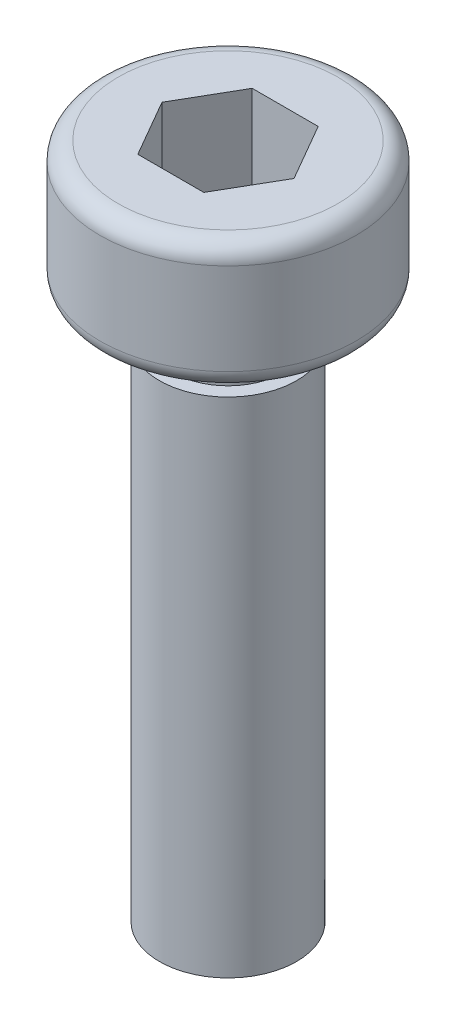
ISO-10303-21;
HEADER;
FILE_DESCRIPTION(('STEP AP214'),'2;1');
FILE_NAME('part.step','',(''),(''),'','','');
FILE_SCHEMA(('AUTOMOTIVE_DESIGN { 1 0 10303 214 1 1 1 1 }'));
ENDSEC;
DATA;
#1=APPLICATION_CONTEXT('core data for automotive mechanical design processes');
#2=APPLICATION_PROTOCOL_DEFINITION('international standard','automotive_design',2000,#1);
#3=PRODUCT_CONTEXT('',#1,'mechanical');
#4=PRODUCT('Part','Part','',(#3));
#5=PRODUCT_RELATED_PRODUCT_CATEGORY('part','',(#4));
#6=PRODUCT_DEFINITION_FORMATION('','',#4);
#7=PRODUCT_DEFINITION_CONTEXT('part definition',#1,'design');
#8=PRODUCT_DEFINITION('design','',#6,#7);
#9=PRODUCT_DEFINITION_SHAPE('','',#8);
#10=(LENGTH_UNIT() NAMED_UNIT(*) SI_UNIT(.MILLI.,.METRE.));
#11=(NAMED_UNIT(*) PLANE_ANGLE_UNIT() SI_UNIT($,.RADIAN.));
#12=(NAMED_UNIT(*) SI_UNIT($,.STERADIAN.) SOLID_ANGLE_UNIT());
#13=UNCERTAINTY_MEASURE_WITH_UNIT(LENGTH_MEASURE(1.E-05),#10,'distance_accuracy_value','');
#14=(GEOMETRIC_REPRESENTATION_CONTEXT(3) GLOBAL_UNCERTAINTY_ASSIGNED_CONTEXT((#13)) GLOBAL_UNIT_ASSIGNED_CONTEXT((#10,
#11,#12)) REPRESENTATION_CONTEXT('',''));
#15=CARTESIAN_POINT('',(0.,0.,0.));
#16=DIRECTION('',(0.,0.,1.));
#17=DIRECTION('',(1.,0.,0.));
#18=AXIS2_PLACEMENT_3D('',#15,#16,#17);
#19=CARTESIAN_POINT('',(0.,14.8,0.));
#20=DIRECTION('',(0.,-1.,0.));
#21=DIRECTION('',(0.,0.,-1.));
#22=AXIS2_PLACEMENT_3D('',#19,#20,#21);
#23=PLANE('',#22);
#24=DIRECTION('',(-0.5,0.,0.866025403784439));
#25=VECTOR('',#24,1.);
#26=CARTESIAN_POINT('',(-0.721687836487032,14.8,-1.25));
#27=LINE('',#26,#25);
#28=CARTESIAN_POINT('',(-0.721687836487032,14.8,-1.25));
#29=VERTEX_POINT('',#28);
#30=CARTESIAN_POINT('',(-1.44337567297406,14.8,0.));
#31=VERTEX_POINT('',#30);
#32=EDGE_CURVE('E124',#29,#31,#27,.T.);
#33=ORIENTED_EDGE('',*,*,#32,.F.);
#34=DIRECTION('',(-1.,0.,0.));
#35=VECTOR('',#34,1.);
#36=CARTESIAN_POINT('',(0.721687836487033,14.8,-1.25));
#37=LINE('',#36,#35);
#38=CARTESIAN_POINT('',(0.721687836487033,14.8,-1.25));
#39=VERTEX_POINT('',#38);
#40=EDGE_CURVE('E50',#39,#29,#37,.T.);
#41=ORIENTED_EDGE('',*,*,#40,.F.);
#42=DIRECTION('',(-0.5,0.,-0.866025403784439));
#43=VECTOR('',#42,1.);
#44=CARTESIAN_POINT('',(1.44337567297406,14.8,0.));
#45=LINE('',#44,#43);
#46=CARTESIAN_POINT('',(1.44337567297406,14.8,0.));
#47=VERTEX_POINT('',#46);
#48=EDGE_CURVE('E133',#47,#39,#45,.T.);
#49=ORIENTED_EDGE('',*,*,#48,.F.);
#50=DIRECTION('',(0.5,0.,-0.866025403784439));
#51=VECTOR('',#50,1.);
#52=CARTESIAN_POINT('',(0.721687836487032,14.8,1.25));
#53=LINE('',#52,#51);
#54=CARTESIAN_POINT('',(0.721687836487032,14.8,1.25));
#55=VERTEX_POINT('',#54);
#56=EDGE_CURVE('E131',#55,#47,#53,.T.);
#57=ORIENTED_EDGE('',*,*,#56,.F.);
#58=DIRECTION('',(1.,0.,0.));
#59=VECTOR('',#58,1.);
#60=CARTESIAN_POINT('',(-0.721687836487033,14.8,1.25));
#61=LINE('',#60,#59);
#62=CARTESIAN_POINT('',(-0.721687836487033,14.8,1.25));
#63=VERTEX_POINT('',#62);
#64=EDGE_CURVE('E98',#63,#55,#61,.T.);
#65=ORIENTED_EDGE('',*,*,#64,.F.);
#66=DIRECTION('',(0.5,0.,0.866025403784439));
#67=VECTOR('',#66,1.);
#68=CARTESIAN_POINT('',(-1.44337567297406,14.8,0.));
#69=LINE('',#68,#67);
#70=EDGE_CURVE('E127',#31,#63,#69,.T.);
#71=ORIENTED_EDGE('',*,*,#70,.F.);
#72=EDGE_LOOP('',(#33,#41,#49,#57,#65,#71));
#73=FACE_BOUND('',#72,.T.);
#74=CARTESIAN_POINT('',(0.,14.8,0.));
#75=DIRECTION('',(0.,-1.,0.));
#76=DIRECTION('',(0.,0.,-1.));
#77=AXIS2_PLACEMENT_3D('',#74,#75,#76);
#78=CIRCLE('',#77,2.4);
#79=CARTESIAN_POINT('',(0.,14.8,-2.4));
#80=VERTEX_POINT('',#79);
#81=EDGE_CURVE('E11',#80,#80,#78,.T.);
#82=ORIENTED_EDGE('',*,*,#81,.F.);
#83=EDGE_LOOP('',(#82));
#84=FACE_BOUND('',#83,.T.);
#85=ADVANCED_FACE('F36',(#73,#84),#23,.F.);
#86=CARTESIAN_POINT('',(0.,14.4,0.));
#87=DIRECTION('',(0.,-1.,0.));
#88=DIRECTION('',(0.,0.,-1.));
#89=AXIS2_PLACEMENT_3D('',#86,#87,#88);
#90=TOROIDAL_SURFACE('',#89,2.4,0.399999999999999);
#91=CARTESIAN_POINT('',(0.,14.4,0.));
#92=DIRECTION('',(0.,-1.,0.));
#93=DIRECTION('',(0.,0.,-1.));
#94=AXIS2_PLACEMENT_3D('',#91,#92,#93);
#95=CIRCLE('',#94,2.8);
#96=CARTESIAN_POINT('',(0.,14.4,-2.8));
#97=VERTEX_POINT('',#96);
#98=EDGE_CURVE('E43',#97,#97,#95,.T.);
#99=ORIENTED_EDGE('',*,*,#98,.F.);
#100=EDGE_LOOP('',(#99));
#101=FACE_BOUND('',#100,.T.);
#102=ORIENTED_EDGE('',*,*,#81,.T.);
#103=EDGE_LOOP('',(#102));
#104=FACE_BOUND('',#103,.T.);
#105=ADVANCED_FACE('F164',(#101,#104),#90,.T.);
#106=CARTESIAN_POINT('',(0.,0.,0.));
#107=DIRECTION('',(0.,-1.,0.));
#108=DIRECTION('',(0.,0.,-1.));
#109=AXIS2_PLACEMENT_3D('',#106,#107,#108);
#110=CYLINDRICAL_SURFACE('',#109,2.8);
#111=CARTESIAN_POINT('',(0.,12.4,0.));
#112=DIRECTION('',(0.,-1.,0.));
#113=DIRECTION('',(0.,0.,-1.));
#114=AXIS2_PLACEMENT_3D('',#111,#112,#113);
#115=CIRCLE('',#114,2.8);
#116=CARTESIAN_POINT('',(0.,12.4,-2.8));
#117=VERTEX_POINT('',#116);
#118=EDGE_CURVE('E157',#117,#117,#115,.T.);
#119=ORIENTED_EDGE('',*,*,#118,.F.);
#120=EDGE_LOOP('',(#119));
#121=FACE_BOUND('',#120,.T.);
#122=ORIENTED_EDGE('',*,*,#98,.T.);
#123=EDGE_LOOP('',(#122));
#124=FACE_BOUND('',#123,.T.);
#125=ADVANCED_FACE('F162',(#121,#124),#110,.T.);
#126=CARTESIAN_POINT('',(0.,12.4,0.));
#127=DIRECTION('',(0.,-1.,0.));
#128=DIRECTION('',(0.,0.,-1.));
#129=AXIS2_PLACEMENT_3D('',#126,#127,#128);
#130=TOROIDAL_SURFACE('',#129,2.4,0.4);
#131=CARTESIAN_POINT('',(0.,12.,0.));
#132=DIRECTION('',(0.,-1.,0.));
#133=DIRECTION('',(0.,0.,-1.));
#134=AXIS2_PLACEMENT_3D('',#131,#132,#133);
#135=CIRCLE('',#134,2.4);
#136=CARTESIAN_POINT('',(0.,12.,-2.4));
#137=VERTEX_POINT('',#136);
#138=EDGE_CURVE('E154',#137,#137,#135,.T.);
#139=ORIENTED_EDGE('',*,*,#138,.F.);
#140=EDGE_LOOP('',(#139));
#141=FACE_BOUND('',#140,.T.);
#142=ORIENTED_EDGE('',*,*,#118,.T.);
#143=EDGE_LOOP('',(#142));
#144=FACE_BOUND('',#143,.T.);
#145=ADVANCED_FACE('F209',(#141,#144),#130,.T.);
#146=CARTESIAN_POINT('',(-2.4,12.,0.));
#147=DIRECTION('',(0.,1.,0.));
#148=DIRECTION('',(0.,0.,1.));
#149=AXIS2_PLACEMENT_3D('',#146,#147,#148);
#150=PLANE('',#149);
#151=CARTESIAN_POINT('',(0.,12.,0.));
#152=DIRECTION('',(0.,-1.,0.));
#153=DIRECTION('',(0.,0.,-1.));
#154=AXIS2_PLACEMENT_3D('',#151,#152,#153);
#155=CIRCLE('',#154,1.2);
#156=CARTESIAN_POINT('',(0.,12.,-1.2));
#157=VERTEX_POINT('',#156);
#158=EDGE_CURVE('E151',#157,#157,#155,.T.);
#159=ORIENTED_EDGE('',*,*,#158,.F.);
#160=EDGE_LOOP('',(#159));
#161=FACE_BOUND('',#160,.T.);
#162=ORIENTED_EDGE('',*,*,#138,.T.);
#163=EDGE_LOOP('',(#162));
#164=FACE_BOUND('',#163,.T.);
#165=ADVANCED_FACE('F205',(#161,#164),#150,.F.);
#166=CARTESIAN_POINT('',(0.,0.,0.));
#167=DIRECTION('',(0.,-1.,0.));
#168=DIRECTION('',(0.,0.,-1.));
#169=AXIS2_PLACEMENT_3D('',#166,#167,#168);
#170=CYLINDRICAL_SURFACE('',#169,1.2);
#171=CARTESIAN_POINT('',(0.,11.,0.));
#172=DIRECTION('',(0.,-1.,0.));
#173=DIRECTION('',(0.,0.,-1.));
#174=AXIS2_PLACEMENT_3D('',#171,#172,#173);
#175=CIRCLE('',#174,1.2);
#176=CARTESIAN_POINT('',(0.,11.,-1.2));
#177=VERTEX_POINT('',#176);
#178=EDGE_CURVE('E148',#177,#177,#175,.T.);
#179=ORIENTED_EDGE('',*,*,#178,.F.);
#180=EDGE_LOOP('',(#179));
#181=FACE_BOUND('',#180,.T.);
#182=ORIENTED_EDGE('',*,*,#158,.T.);
#183=EDGE_LOOP('',(#182));
#184=FACE_BOUND('',#183,.T.);
#185=ADVANCED_FACE('F201',(#181,#184),#170,.T.);
#186=CARTESIAN_POINT('',(-1.2,11.,0.));
#187=DIRECTION('',(0.,-1.,0.));
#188=DIRECTION('',(0.,0.,-1.));
#189=AXIS2_PLACEMENT_3D('',#186,#187,#188);
#190=PLANE('',#189);
#191=CARTESIAN_POINT('',(0.,11.,0.));
#192=DIRECTION('',(0.,-1.,0.));
#193=DIRECTION('',(0.,0.,-1.));
#194=AXIS2_PLACEMENT_3D('',#191,#192,#193);
#195=CIRCLE('',#194,1.5);
#196=CARTESIAN_POINT('',(0.,11.,-1.5));
#197=VERTEX_POINT('',#196);
#198=EDGE_CURVE('E145',#197,#197,#195,.T.);
#199=ORIENTED_EDGE('',*,*,#198,.F.);
#200=EDGE_LOOP('',(#199));
#201=FACE_BOUND('',#200,.T.);
#202=ORIENTED_EDGE('',*,*,#178,.T.);
#203=EDGE_LOOP('',(#202));
#204=FACE_BOUND('',#203,.T.);
#205=ADVANCED_FACE('F197',(#201,#204),#190,.F.);
#206=CARTESIAN_POINT('',(0.,0.,0.));
#207=DIRECTION('',(0.,-1.,0.));
#208=DIRECTION('',(0.,0.,-1.));
#209=AXIS2_PLACEMENT_3D('',#206,#207,#208);
#210=CYLINDRICAL_SURFACE('',#209,1.5);
#211=CARTESIAN_POINT('',(0.,0.,0.));
#212=DIRECTION('',(0.,-1.,0.));
#213=DIRECTION('',(0.,0.,-1.));
#214=AXIS2_PLACEMENT_3D('',#211,#212,#213);
#215=CIRCLE('',#214,1.5);
#216=CARTESIAN_POINT('',(0.,0.,-1.5));
#217=VERTEX_POINT('',#216);
#218=EDGE_CURVE('E137',#217,#217,#215,.T.);
#219=ORIENTED_EDGE('',*,*,#218,.F.);
#220=EDGE_LOOP('',(#219));
#221=FACE_BOUND('',#220,.T.);
#222=ORIENTED_EDGE('',*,*,#198,.T.);
#223=EDGE_LOOP('',(#222));
#224=FACE_BOUND('',#223,.T.);
#225=ADVANCED_FACE('F189',(#221,#224),#210,.T.);
#226=CARTESIAN_POINT('',(-1.5,0.,0.));
#227=DIRECTION('',(0.,1.,0.));
#228=DIRECTION('',(0.,0.,1.));
#229=AXIS2_PLACEMENT_3D('',#226,#227,#228);
#230=PLANE('',#229);
#231=ORIENTED_EDGE('',*,*,#218,.T.);
#232=EDGE_LOOP('',(#231));
#233=FACE_BOUND('',#232,.T.);
#234=ADVANCED_FACE('F182',(#233),#230,.F.);
#235=CARTESIAN_POINT('',(0.721687836487033,12.8,-1.25));
#236=DIRECTION('',(0.,0.,-1.));
#237=DIRECTION('',(-1.,0.,0.));
#238=AXIS2_PLACEMENT_3D('',#235,#236,#237);
#239=PLANE('',#238);
#240=ORIENTED_EDGE('',*,*,#40,.T.);
#241=DIRECTION('',(0.,1.,0.));
#242=VECTOR('',#241,1.);
#243=CARTESIAN_POINT('',(-0.721687836487032,12.8,-1.25));
#244=LINE('',#243,#242);
#245=CARTESIAN_POINT('',(-0.721687836487032,12.8,-1.25));
#246=VERTEX_POINT('',#245);
#247=EDGE_CURVE('E80',#246,#29,#244,.T.);
#248=ORIENTED_EDGE('',*,*,#247,.F.);
#249=DIRECTION('',(-1.,0.,0.));
#250=VECTOR('',#249,1.);
#251=CARTESIAN_POINT('',(0.721687836487033,12.8,-1.25));
#252=LINE('',#251,#250);
#253=CARTESIAN_POINT('',(0.721687836487033,12.8,-1.25));
#254=VERTEX_POINT('',#253);
#255=EDGE_CURVE('E135',#254,#246,#252,.T.);
#256=ORIENTED_EDGE('',*,*,#255,.F.);
#257=DIRECTION('',(0.,1.,0.));
#258=VECTOR('',#257,1.);
#259=CARTESIAN_POINT('',(0.721687836487033,12.8,-1.25));
#260=LINE('',#259,#258);
#261=EDGE_CURVE('E58',#254,#39,#260,.T.);
#262=ORIENTED_EDGE('',*,*,#261,.T.);
#263=EDGE_LOOP('',(#240,#248,#256,#262));
#264=FACE_BOUND('',#263,.T.);
#265=ADVANCED_FACE('F179',(#264),#239,.F.);
#266=CARTESIAN_POINT('',(1.44337567297406,12.8,0.));
#267=DIRECTION('',(0.866025403784439,0.,-0.5));
#268=DIRECTION('',(-0.5,0.,-0.866025403784439));
#269=AXIS2_PLACEMENT_3D('',#266,#267,#268);
#270=PLANE('',#269);
#271=ORIENTED_EDGE('',*,*,#48,.T.);
#272=ORIENTED_EDGE('',*,*,#261,.F.);
#273=DIRECTION('',(-0.5,0.,-0.866025403784439));
#274=VECTOR('',#273,1.);
#275=CARTESIAN_POINT('',(1.44337567297406,12.8,0.));
#276=LINE('',#275,#274);
#277=CARTESIAN_POINT('',(1.44337567297406,12.8,0.));
#278=VERTEX_POINT('',#277);
#279=EDGE_CURVE('E110',#278,#254,#276,.T.);
#280=ORIENTED_EDGE('',*,*,#279,.F.);
#281=DIRECTION('',(0.,1.,0.));
#282=VECTOR('',#281,1.);
#283=CARTESIAN_POINT('',(1.44337567297406,12.8,0.));
#284=LINE('',#283,#282);
#285=EDGE_CURVE('E102',#278,#47,#284,.T.);
#286=ORIENTED_EDGE('',*,*,#285,.T.);
#287=EDGE_LOOP('',(#271,#272,#280,#286));
#288=FACE_BOUND('',#287,.T.);
#289=ADVANCED_FACE('F181',(#288),#270,.F.);
#290=CARTESIAN_POINT('',(0.721687836487032,12.8,1.25));
#291=DIRECTION('',(0.866025403784439,0.,0.5));
#292=DIRECTION('',(0.5,0.,-0.866025403784439));
#293=AXIS2_PLACEMENT_3D('',#290,#291,#292);
#294=PLANE('',#293);
#295=ORIENTED_EDGE('',*,*,#56,.T.);
#296=ORIENTED_EDGE('',*,*,#285,.F.);
#297=DIRECTION('',(0.5,0.,-0.866025403784439));
#298=VECTOR('',#297,1.);
#299=CARTESIAN_POINT('',(0.721687836487032,12.8,1.25));
#300=LINE('',#299,#298);
#301=CARTESIAN_POINT('',(0.721687836487032,12.8,1.25));
#302=VERTEX_POINT('',#301);
#303=EDGE_CURVE('E106',#302,#278,#300,.T.);
#304=ORIENTED_EDGE('',*,*,#303,.F.);
#305=DIRECTION('',(0.,1.,0.));
#306=VECTOR('',#305,1.);
#307=CARTESIAN_POINT('',(0.721687836487032,12.8,1.25));
#308=LINE('',#307,#306);
#309=EDGE_CURVE('E91',#302,#55,#308,.T.);
#310=ORIENTED_EDGE('',*,*,#309,.T.);
#311=EDGE_LOOP('',(#295,#296,#304,#310));
#312=FACE_BOUND('',#311,.T.);
#313=ADVANCED_FACE('F107',(#312),#294,.F.);
#314=CARTESIAN_POINT('',(-0.721687836487033,12.8,1.25));
#315=DIRECTION('',(0.,0.,1.));
#316=DIRECTION('',(1.,0.,0.));
#317=AXIS2_PLACEMENT_3D('',#314,#315,#316);
#318=PLANE('',#317);
#319=ORIENTED_EDGE('',*,*,#64,.T.);
#320=ORIENTED_EDGE('',*,*,#309,.F.);
#321=DIRECTION('',(1.,0.,0.));
#322=VECTOR('',#321,1.);
#323=CARTESIAN_POINT('',(-0.721687836487033,12.8,1.25));
#324=LINE('',#323,#322);
#325=CARTESIAN_POINT('',(-0.721687836487033,12.8,1.25));
#326=VERTEX_POINT('',#325);
#327=EDGE_CURVE('E95',#326,#302,#324,.T.);
#328=ORIENTED_EDGE('',*,*,#327,.F.);
#329=DIRECTION('',(0.,1.,0.));
#330=VECTOR('',#329,1.);
#331=CARTESIAN_POINT('',(-0.721687836487033,12.8,1.25));
#332=LINE('',#331,#330);
#333=EDGE_CURVE('E103',#326,#63,#332,.T.);
#334=ORIENTED_EDGE('',*,*,#333,.T.);
#335=EDGE_LOOP('',(#319,#320,#328,#334));
#336=FACE_BOUND('',#335,.T.);
#337=ADVANCED_FACE('F93',(#336),#318,.F.);
#338=CARTESIAN_POINT('',(-1.44337567297406,12.8,0.));
#339=DIRECTION('',(-0.866025403784439,0.,0.5));
#340=DIRECTION('',(0.5,0.,0.866025403784439));
#341=AXIS2_PLACEMENT_3D('',#338,#339,#340);
#342=PLANE('',#341);
#343=ORIENTED_EDGE('',*,*,#70,.T.);
#344=ORIENTED_EDGE('',*,*,#333,.F.);
#345=DIRECTION('',(0.5,0.,0.866025403784439));
#346=VECTOR('',#345,1.);
#347=CARTESIAN_POINT('',(-1.44337567297406,12.8,0.));
#348=LINE('',#347,#346);
#349=CARTESIAN_POINT('',(-1.44337567297406,12.8,0.));
#350=VERTEX_POINT('',#349);
#351=EDGE_CURVE('E116',#350,#326,#348,.T.);
#352=ORIENTED_EDGE('',*,*,#351,.F.);
#353=DIRECTION('',(0.,1.,0.));
#354=VECTOR('',#353,1.);
#355=CARTESIAN_POINT('',(-1.44337567297406,12.8,0.));
#356=LINE('',#355,#354);
#357=EDGE_CURVE('E140',#350,#31,#356,.T.);
#358=ORIENTED_EDGE('',*,*,#357,.T.);
#359=EDGE_LOOP('',(#343,#344,#352,#358));
#360=FACE_BOUND('',#359,.T.);
#361=ADVANCED_FACE('F280',(#360),#342,.F.);
#362=CARTESIAN_POINT('',(-0.721687836487032,12.8,-1.25));
#363=DIRECTION('',(-0.866025403784439,0.,-0.5));
#364=DIRECTION('',(-0.5,0.,0.866025403784439));
#365=AXIS2_PLACEMENT_3D('',#362,#363,#364);
#366=PLANE('',#365);
#367=ORIENTED_EDGE('',*,*,#32,.T.);
#368=ORIENTED_EDGE('',*,*,#357,.F.);
#369=DIRECTION('',(-0.5,0.,0.866025403784439));
#370=VECTOR('',#369,1.);
#371=CARTESIAN_POINT('',(-0.721687836487032,12.8,-1.25));
#372=LINE('',#371,#370);
#373=EDGE_CURVE('E118',#246,#350,#372,.T.);
#374=ORIENTED_EDGE('',*,*,#373,.F.);
#375=ORIENTED_EDGE('',*,*,#247,.T.);
#376=EDGE_LOOP('',(#367,#368,#374,#375));
#377=FACE_BOUND('',#376,.T.);
#378=ADVANCED_FACE('F177',(#377),#366,.F.);
#379=CARTESIAN_POINT('',(0.,12.8,0.));
#380=DIRECTION('',(0.,1.,0.));
#381=DIRECTION('',(0.,0.,1.));
#382=AXIS2_PLACEMENT_3D('',#379,#380,#381);
#383=PLANE('',#382);
#384=ORIENTED_EDGE('',*,*,#255,.T.);
#385=ORIENTED_EDGE('',*,*,#373,.T.);
#386=ORIENTED_EDGE('',*,*,#351,.T.);
#387=ORIENTED_EDGE('',*,*,#327,.T.);
#388=ORIENTED_EDGE('',*,*,#303,.T.);
#389=ORIENTED_EDGE('',*,*,#279,.T.);
#390=EDGE_LOOP('',(#384,#385,#386,#387,#388,#389));
#391=FACE_BOUND('',#390,.T.);
#392=ADVANCED_FACE('F113',(#391),#383,.T.);
#393=CLOSED_SHELL('',(#85,#105,#125,#145,#165,#185,#205,#225,#234,#265,#289,#313,#337,#361,#378,#392));
#394=MANIFOLD_SOLID_BREP('B2',#393);
#395=ADVANCED_BREP_SHAPE_REPRESENTATION('',(#18,#394),#14);
#396=SHAPE_DEFINITION_REPRESENTATION(#9,#395);
ENDSEC;
END-ISO-10303-21;
